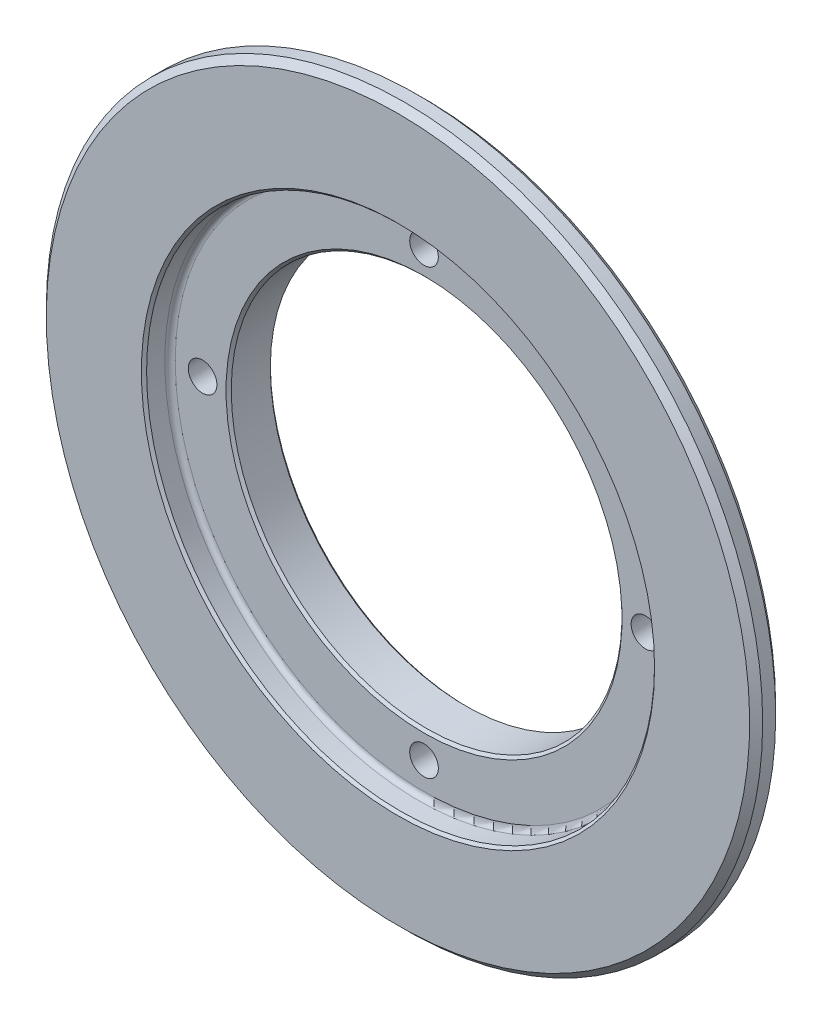
ISO-10303-21;
HEADER;
FILE_DESCRIPTION(('STEP AP214'),'2;1');
FILE_NAME('part.step','',(''),(''),'','','');
FILE_SCHEMA(('AUTOMOTIVE_DESIGN { 1 0 10303 214 1 1 1 1 }'));
ENDSEC;
DATA;
#1=APPLICATION_CONTEXT('core data for automotive mechanical design processes');
#2=APPLICATION_PROTOCOL_DEFINITION('international standard','automotive_design',2000,#1);
#3=PRODUCT_CONTEXT('',#1,'mechanical');
#4=PRODUCT('Part','Part','',(#3));
#5=PRODUCT_RELATED_PRODUCT_CATEGORY('part','',(#4));
#6=PRODUCT_DEFINITION_FORMATION('','',#4);
#7=PRODUCT_DEFINITION_CONTEXT('part definition',#1,'design');
#8=PRODUCT_DEFINITION('design','',#6,#7);
#9=PRODUCT_DEFINITION_SHAPE('','',#8);
#10=(LENGTH_UNIT() NAMED_UNIT(*) SI_UNIT(.MILLI.,.METRE.));
#11=(NAMED_UNIT(*) PLANE_ANGLE_UNIT() SI_UNIT($,.RADIAN.));
#12=(NAMED_UNIT(*) SI_UNIT($,.STERADIAN.) SOLID_ANGLE_UNIT());
#13=UNCERTAINTY_MEASURE_WITH_UNIT(LENGTH_MEASURE(1.E-05),#10,'distance_accuracy_value','');
#14=(GEOMETRIC_REPRESENTATION_CONTEXT(3) GLOBAL_UNCERTAINTY_ASSIGNED_CONTEXT((#13)) GLOBAL_UNIT_ASSIGNED_CONTEXT((#10,
#11,#12)) REPRESENTATION_CONTEXT('',''));
#15=CARTESIAN_POINT('',(0.,0.,0.));
#16=DIRECTION('',(0.,0.,1.));
#17=DIRECTION('',(1.,0.,0.));
#18=AXIS2_PLACEMENT_3D('',#15,#16,#17);
#19=CARTESIAN_POINT('',(0.,0.,0.500000000000043));
#20=DIRECTION('',(0.,0.,1.));
#21=DIRECTION('',(1.,0.,0.));
#22=AXIS2_PLACEMENT_3D('',#19,#20,#21);
#23=CONICAL_SURFACE('',#22,21.,0.7853981633973);
#24=CARTESIAN_POINT('',(0.,0.,0.5));
#25=DIRECTION('',(0.,0.,1.));
#26=DIRECTION('',(1.,0.,0.));
#27=AXIS2_PLACEMENT_3D('',#24,#25,#26);
#28=CIRCLE('',#27,21.);
#29=CARTESIAN_POINT('',(21.,0.,0.5));
#30=VERTEX_POINT('',#29);
#31=EDGE_CURVE('E123',#30,#30,#28,.T.);
#32=ORIENTED_EDGE('',*,*,#31,.F.);
#33=EDGE_LOOP('',(#32));
#34=FACE_BOUND('',#33,.T.);
#35=CARTESIAN_POINT('',(0.,0.,0.));
#36=DIRECTION('',(0.,0.,1.));
#37=DIRECTION('',(1.,0.,0.));
#38=AXIS2_PLACEMENT_3D('',#35,#36,#37);
#39=CIRCLE('',#38,20.5);
#40=CARTESIAN_POINT('',(20.5,0.,0.));
#41=VERTEX_POINT('',#40);
#42=EDGE_CURVE('E122',#41,#41,#39,.T.);
#43=ORIENTED_EDGE('',*,*,#42,.T.);
#44=EDGE_LOOP('',(#43));
#45=FACE_BOUND('',#44,.T.);
#46=ADVANCED_FACE('F17',(#34,#45),#23,.T.);
#47=CARTESIAN_POINT('',(0.,0.,0.));
#48=DIRECTION('',(0.,0.,-1.));
#49=DIRECTION('',(-1.,0.,0.));
#50=AXIS2_PLACEMENT_3D('',#47,#48,#49);
#51=CONICAL_SURFACE('',#50,15.2,0.785398163397301);
#52=CARTESIAN_POINT('',(0.,0.,0.2));
#53=DIRECTION('',(0.,0.,1.));
#54=DIRECTION('',(1.,0.,0.));
#55=AXIS2_PLACEMENT_3D('',#52,#53,#54);
#56=CIRCLE('',#55,15.);
#57=CARTESIAN_POINT('',(15.,0.,0.2));
#58=VERTEX_POINT('',#57);
#59=EDGE_CURVE('E119',#58,#58,#56,.T.);
#60=ORIENTED_EDGE('',*,*,#59,.T.);
#61=EDGE_LOOP('',(#60));
#62=FACE_BOUND('',#61,.T.);
#63=CARTESIAN_POINT('',(0.,0.,0.));
#64=DIRECTION('',(0.,0.,-1.));
#65=DIRECTION('',(-1.,0.,0.));
#66=AXIS2_PLACEMENT_3D('',#63,#64,#65);
#67=CIRCLE('',#66,15.2);
#68=CARTESIAN_POINT('',(-15.2,0.,0.));
#69=VERTEX_POINT('',#68);
#70=EDGE_CURVE('E118',#69,#69,#67,.T.);
#71=ORIENTED_EDGE('',*,*,#70,.T.);
#72=EDGE_LOOP('',(#71));
#73=FACE_BOUND('',#72,.T.);
#74=ADVANCED_FACE('F275',(#62,#73),#51,.F.);
#75=CARTESIAN_POINT('',(0.,0.,-0.17));
#76=DIRECTION('',(0.,0.,1.));
#77=DIRECTION('',(1.,0.,0.));
#78=AXIS2_PLACEMENT_3D('',#75,#76,#77);
#79=CYLINDRICAL_SURFACE('',#78,21.);
#80=ORIENTED_EDGE('',*,*,#31,.T.);
#81=EDGE_LOOP('',(#80));
#82=FACE_BOUND('',#81,.T.);
#83=CARTESIAN_POINT('',(0.,0.,3.));
#84=DIRECTION('',(0.,0.,1.));
#85=DIRECTION('',(0.00767535320891425,0.999970544042732,0.));
#86=AXIS2_PLACEMENT_3D('',#83,#84,#85);
#87=CIRCLE('',#86,21.);
#88=CARTESIAN_POINT('',(0.161182417387199,20.9993814248974,3.));
#89=VERTEX_POINT('',#88);
#90=EDGE_CURVE('E114',#89,#89,#87,.F.);
#91=ORIENTED_EDGE('',*,*,#90,.T.);
#92=EDGE_LOOP('',(#91));
#93=FACE_BOUND('',#92,.T.);
#94=ADVANCED_FACE('F280',(#82,#93),#79,.T.);
#95=CARTESIAN_POINT('',(0.,0.,-0.837));
#96=DIRECTION('',(0.,0.,1.));
#97=DIRECTION('',(1.,0.,0.));
#98=AXIS2_PLACEMENT_3D('',#95,#96,#97);
#99=CYLINDRICAL_SURFACE('',#98,15.);
#100=CARTESIAN_POINT('',(0.,0.,3.19999999999998));
#101=DIRECTION('',(0.,0.,1.));
#102=DIRECTION('',(-1.,0.,0.));
#103=AXIS2_PLACEMENT_3D('',#100,#101,#102);
#104=CIRCLE('',#103,15.);
#105=CARTESIAN_POINT('',(-15.,0.,3.19999999999998));
#106=VERTEX_POINT('',#105);
#107=EDGE_CURVE('E105',#106,#106,#104,.T.);
#108=ORIENTED_EDGE('',*,*,#107,.T.);
#109=EDGE_LOOP('',(#108));
#110=FACE_BOUND('',#109,.T.);
#111=ORIENTED_EDGE('',*,*,#59,.F.);
#112=EDGE_LOOP('',(#111));
#113=FACE_BOUND('',#112,.T.);
#114=ADVANCED_FACE('F270',(#110,#113),#99,.F.);
#115=CARTESIAN_POINT('',(0.,0.,0.));
#116=DIRECTION('',(0.,0.,1.));
#117=DIRECTION('',(1.,0.,0.));
#118=AXIS2_PLACEMENT_3D('',#115,#116,#117);
#119=PLANE('',#118);
#120=CARTESIAN_POINT('',(0.,17.,0.));
#121=DIRECTION('',(0.,0.,-1.));
#122=DIRECTION('',(-1.,0.,0.));
#123=AXIS2_PLACEMENT_3D('',#120,#121,#122);
#124=CIRCLE('',#123,1.1);
#125=CARTESIAN_POINT('',(-1.1,17.,0.));
#126=VERTEX_POINT('',#125);
#127=EDGE_CURVE('E59',#126,#126,#124,.F.);
#128=ORIENTED_EDGE('',*,*,#127,.T.);
#129=EDGE_LOOP('',(#128));
#130=FACE_BOUND('',#129,.T.);
#131=ORIENTED_EDGE('',*,*,#70,.F.);
#132=EDGE_LOOP('',(#131));
#133=FACE_BOUND('',#132,.T.);
#134=CARTESIAN_POINT('',(17.,0.,0.));
#135=DIRECTION('',(0.,0.,-1.));
#136=DIRECTION('',(-1.,0.,0.));
#137=AXIS2_PLACEMENT_3D('',#134,#135,#136);
#138=CIRCLE('',#137,1.1);
#139=CARTESIAN_POINT('',(15.9,0.,0.));
#140=VERTEX_POINT('',#139);
#141=EDGE_CURVE('E113',#140,#140,#138,.F.);
#142=ORIENTED_EDGE('',*,*,#141,.T.);
#143=EDGE_LOOP('',(#142));
#144=FACE_BOUND('',#143,.T.);
#145=CARTESIAN_POINT('',(0.,-17.,0.));
#146=DIRECTION('',(0.,0.,-1.));
#147=DIRECTION('',(-1.,0.,0.));
#148=AXIS2_PLACEMENT_3D('',#145,#146,#147);
#149=CIRCLE('',#148,1.1);
#150=CARTESIAN_POINT('',(-1.1,-17.,0.));
#151=VERTEX_POINT('',#150);
#152=EDGE_CURVE('E151',#151,#151,#149,.F.);
#153=ORIENTED_EDGE('',*,*,#152,.T.);
#154=EDGE_LOOP('',(#153));
#155=FACE_BOUND('',#154,.T.);
#156=CARTESIAN_POINT('',(-17.,0.,0.));
#157=DIRECTION('',(0.,0.,-1.));
#158=DIRECTION('',(-1.,0.,0.));
#159=AXIS2_PLACEMENT_3D('',#156,#157,#158);
#160=CIRCLE('',#159,1.1);
#161=CARTESIAN_POINT('',(-18.1,0.,0.));
#162=VERTEX_POINT('',#161);
#163=EDGE_CURVE('E117',#162,#162,#160,.F.);
#164=ORIENTED_EDGE('',*,*,#163,.T.);
#165=EDGE_LOOP('',(#164));
#166=FACE_BOUND('',#165,.T.);
#167=ORIENTED_EDGE('',*,*,#42,.F.);
#168=EDGE_LOOP('',(#167));
#169=FACE_BOUND('',#168,.T.);
#170=ADVANCED_FACE('F98',(#130,#133,#144,#155,#166,#169),#119,.F.);
#171=CARTESIAN_POINT('',(0.,0.,3.));
#172=DIRECTION('',(0.,0.,1.));
#173=DIRECTION('',(0.00767535320891425,0.999970544042732,0.));
#174=AXIS2_PLACEMENT_3D('',#171,#172,#173);
#175=TOROIDAL_SURFACE('',#174,21.4,0.4);
#176=CARTESIAN_POINT('',(0.,0.,3.4));
#177=DIRECTION('',(0.,0.,-1.));
#178=DIRECTION('',(0.,-1.,0.));
#179=AXIS2_PLACEMENT_3D('',#176,#177,#178);
#180=CIRCLE('',#179,21.400000027635);
#181=CARTESIAN_POINT('',(0.,-21.400000038689,3.4));
#182=VERTEX_POINT('',#181);
#183=CARTESIAN_POINT('',(0.,21.400000038689,3.4));
#184=VERTEX_POINT('',#183);
#185=EDGE_CURVE('E47',#182,#184,#180,.T.);
#186=ORIENTED_EDGE('',*,*,#185,.T.);
#187=CARTESIAN_POINT('',(0.,0.,3.4));
#188=DIRECTION('',(0.,0.,-1.));
#189=DIRECTION('',(0.,1.,0.));
#190=AXIS2_PLACEMENT_3D('',#187,#188,#189);
#191=CIRCLE('',#190,21.40000005527);
#192=EDGE_CURVE('E45',#184,#182,#191,.T.);
#193=ORIENTED_EDGE('',*,*,#192,.T.);
#194=EDGE_LOOP('',(#186,#193));
#195=FACE_BOUND('',#194,.T.);
#196=ORIENTED_EDGE('',*,*,#90,.F.);
#197=EDGE_LOOP('',(#196));
#198=FACE_BOUND('',#197,.T.);
#199=ADVANCED_FACE('F49',(#195,#198),#175,.F.);
#200=CARTESIAN_POINT('',(-17.,0.,3.4));
#201=DIRECTION('',(0.,0.,-1.));
#202=DIRECTION('',(-1.,0.,0.));
#203=AXIS2_PLACEMENT_3D('',#200,#201,#202);
#204=CYLINDRICAL_SURFACE('',#203,1.1);
#205=CARTESIAN_POINT('',(-17.,0.,3.4));
#206=DIRECTION('',(0.,0.,-1.));
#207=DIRECTION('',(-1.,0.,0.));
#208=AXIS2_PLACEMENT_3D('',#205,#206,#207);
#209=CIRCLE('',#208,1.1);
#210=CARTESIAN_POINT('',(-18.1,0.,3.4));
#211=VERTEX_POINT('',#210);
#212=EDGE_CURVE('E53',#211,#211,#209,.T.);
#213=ORIENTED_EDGE('',*,*,#212,.F.);
#214=EDGE_LOOP('',(#213));
#215=FACE_BOUND('',#214,.T.);
#216=ORIENTED_EDGE('',*,*,#163,.F.);
#217=EDGE_LOOP('',(#216));
#218=FACE_BOUND('',#217,.T.);
#219=ADVANCED_FACE('F97',(#215,#218),#204,.F.);
#220=CARTESIAN_POINT('',(0.,-17.,3.4));
#221=DIRECTION('',(0.,0.,-1.));
#222=DIRECTION('',(-1.,0.,0.));
#223=AXIS2_PLACEMENT_3D('',#220,#221,#222);
#224=CYLINDRICAL_SURFACE('',#223,1.1);
#225=CARTESIAN_POINT('',(0.,-17.,3.4));
#226=DIRECTION('',(0.,0.,-1.));
#227=DIRECTION('',(-1.,0.,0.));
#228=AXIS2_PLACEMENT_3D('',#225,#226,#227);
#229=CIRCLE('',#228,1.1);
#230=CARTESIAN_POINT('',(-1.1,-17.,3.4));
#231=VERTEX_POINT('',#230);
#232=EDGE_CURVE('E142',#231,#231,#229,.T.);
#233=ORIENTED_EDGE('',*,*,#232,.F.);
#234=EDGE_LOOP('',(#233));
#235=FACE_BOUND('',#234,.T.);
#236=ORIENTED_EDGE('',*,*,#152,.F.);
#237=EDGE_LOOP('',(#236));
#238=FACE_BOUND('',#237,.T.);
#239=ADVANCED_FACE('F265',(#235,#238),#224,.F.);
#240=CARTESIAN_POINT('',(17.,0.,3.4));
#241=DIRECTION('',(0.,0.,-1.));
#242=DIRECTION('',(-1.,0.,0.));
#243=AXIS2_PLACEMENT_3D('',#240,#241,#242);
#244=CYLINDRICAL_SURFACE('',#243,1.1);
#245=CARTESIAN_POINT('',(17.,0.,3.4));
#246=DIRECTION('',(0.,0.,-1.));
#247=DIRECTION('',(-1.,0.,0.));
#248=AXIS2_PLACEMENT_3D('',#245,#246,#247);
#249=CIRCLE('',#248,1.1);
#250=CARTESIAN_POINT('',(15.9,0.,3.4));
#251=VERTEX_POINT('',#250);
#252=EDGE_CURVE('E139',#251,#251,#249,.T.);
#253=ORIENTED_EDGE('',*,*,#252,.F.);
#254=EDGE_LOOP('',(#253));
#255=FACE_BOUND('',#254,.T.);
#256=ORIENTED_EDGE('',*,*,#141,.F.);
#257=EDGE_LOOP('',(#256));
#258=FACE_BOUND('',#257,.T.);
#259=ADVANCED_FACE('F306',(#255,#258),#244,.F.);
#260=CARTESIAN_POINT('',(0.,0.,3.40000000000002));
#261=DIRECTION('',(0.,0.,1.));
#262=DIRECTION('',(0.,-1.,0.));
#263=AXIS2_PLACEMENT_3D('',#260,#261,#262);
#264=CONICAL_SURFACE('',#263,15.2,0.785398163397299);
#265=ORIENTED_EDGE('',*,*,#107,.F.);
#266=EDGE_LOOP('',(#265));
#267=FACE_BOUND('',#266,.T.);
#268=CARTESIAN_POINT('',(0.,0.,3.40000000000002));
#269=DIRECTION('',(0.,0.,1.));
#270=DIRECTION('',(0.,-1.,0.));
#271=AXIS2_PLACEMENT_3D('',#268,#269,#270);
#272=CIRCLE('',#271,15.2);
#273=CARTESIAN_POINT('',(0.,-15.2,3.40000000000002));
#274=VERTEX_POINT('',#273);
#275=EDGE_CURVE('E136',#274,#274,#272,.F.);
#276=ORIENTED_EDGE('',*,*,#275,.F.);
#277=EDGE_LOOP('',(#276));
#278=FACE_BOUND('',#277,.T.);
#279=ADVANCED_FACE('F311',(#267,#278),#264,.F.);
#280=CARTESIAN_POINT('',(0.,17.,3.4));
#281=DIRECTION('',(0.,0.,-1.));
#282=DIRECTION('',(-1.,0.,0.));
#283=AXIS2_PLACEMENT_3D('',#280,#281,#282);
#284=CYLINDRICAL_SURFACE('',#283,1.1);
#285=CARTESIAN_POINT('',(0.,17.,3.4));
#286=DIRECTION('',(0.,0.,-1.));
#287=DIRECTION('',(-1.,0.,0.));
#288=AXIS2_PLACEMENT_3D('',#285,#286,#287);
#289=CIRCLE('',#288,1.1);
#290=CARTESIAN_POINT('',(-1.1,17.,3.4));
#291=VERTEX_POINT('',#290);
#292=EDGE_CURVE('E133',#291,#291,#289,.T.);
#293=ORIENTED_EDGE('',*,*,#292,.F.);
#294=EDGE_LOOP('',(#293));
#295=FACE_BOUND('',#294,.T.);
#296=ORIENTED_EDGE('',*,*,#127,.F.);
#297=EDGE_LOOP('',(#296));
#298=FACE_BOUND('',#297,.T.);
#299=ADVANCED_FACE('F80',(#295,#298),#284,.F.);
#300=CARTESIAN_POINT('',(0.,0.,3.4));
#301=DIRECTION('',(0.,0.,1.));
#302=DIRECTION('',(1.,0.,0.));
#303=AXIS2_PLACEMENT_3D('',#300,#301,#302);
#304=PLANE('',#303);
#305=ORIENTED_EDGE('',*,*,#192,.F.);
#306=ORIENTED_EDGE('',*,*,#185,.F.);
#307=EDGE_LOOP('',(#305,#306));
#308=FACE_BOUND('',#307,.T.);
#309=CARTESIAN_POINT('',(0.,0.,3.39999999999996));
#310=DIRECTION('',(0.,0.,1.));
#311=DIRECTION('',(1.,0.,0.));
#312=AXIS2_PLACEMENT_3D('',#309,#310,#311);
#313=CIRCLE('',#312,27.);
#314=CARTESIAN_POINT('',(27.,0.,3.39999999999996));
#315=VERTEX_POINT('',#314);
#316=EDGE_CURVE('E129',#315,#315,#313,.T.);
#317=ORIENTED_EDGE('',*,*,#316,.F.);
#318=EDGE_LOOP('',(#317));
#319=FACE_BOUND('',#318,.T.);
#320=ADVANCED_FACE('F57',(#308,#319),#304,.F.);
#321=CARTESIAN_POINT('',(0.,0.,3.4));
#322=DIRECTION('',(0.,0.,1.));
#323=DIRECTION('',(1.,0.,0.));
#324=AXIS2_PLACEMENT_3D('',#321,#322,#323);
#325=PLANE('',#324);
#326=ORIENTED_EDGE('',*,*,#292,.T.);
#327=EDGE_LOOP('',(#326));
#328=FACE_BOUND('',#327,.T.);
#329=ORIENTED_EDGE('',*,*,#275,.T.);
#330=EDGE_LOOP('',(#329));
#331=FACE_BOUND('',#330,.T.);
#332=ORIENTED_EDGE('',*,*,#252,.T.);
#333=EDGE_LOOP('',(#332));
#334=FACE_BOUND('',#333,.T.);
#335=ORIENTED_EDGE('',*,*,#232,.T.);
#336=EDGE_LOOP('',(#335));
#337=FACE_BOUND('',#336,.T.);
#338=ORIENTED_EDGE('',*,*,#212,.T.);
#339=EDGE_LOOP('',(#338));
#340=FACE_BOUND('',#339,.T.);
#341=CARTESIAN_POINT('',(0.,0.,3.40000000000001));
#342=DIRECTION('',(0.,0.,-1.));
#343=DIRECTION('',(1.,0.,0.));
#344=AXIS2_PLACEMENT_3D('',#341,#342,#343);
#345=CIRCLE('',#344,19.10000006849);
#346=CARTESIAN_POINT('',(-19.100000061641,0.,3.4));
#347=VERTEX_POINT('',#346);
#348=CARTESIAN_POINT('',(19.100000061641,0.,3.4));
#349=VERTEX_POINT('',#348);
#350=EDGE_CURVE('E36',#347,#349,#345,.F.);
#351=ORIENTED_EDGE('',*,*,#350,.T.);
#352=CARTESIAN_POINT('',(0.,0.,3.40000000000001));
#353=DIRECTION('',(0.,0.,-1.));
#354=DIRECTION('',(-1.,0.,0.));
#355=AXIS2_PLACEMENT_3D('',#352,#353,#354);
#356=CIRCLE('',#355,19.10000006849);
#357=EDGE_CURVE('E132',#349,#347,#356,.F.);
#358=ORIENTED_EDGE('',*,*,#357,.T.);
#359=EDGE_LOOP('',(#351,#358));
#360=FACE_BOUND('',#359,.T.);
#361=ADVANCED_FACE('F79',(#328,#331,#334,#337,#340,#360),#325,.T.);
#362=CARTESIAN_POINT('',(0.,0.,3.90000000000004));
#363=DIRECTION('',(0.,0.,1.));
#364=DIRECTION('',(1.,0.,0.));
#365=AXIS2_PLACEMENT_3D('',#362,#363,#364);
#366=CONICAL_SURFACE('',#365,27.5,0.785398163397299);
#367=ORIENTED_EDGE('',*,*,#316,.T.);
#368=EDGE_LOOP('',(#367));
#369=FACE_BOUND('',#368,.T.);
#370=CARTESIAN_POINT('',(0.,0.,3.9));
#371=DIRECTION('',(0.,0.,1.));
#372=DIRECTION('',(1.,0.,0.));
#373=AXIS2_PLACEMENT_3D('',#370,#371,#372);
#374=CIRCLE('',#373,27.5);
#375=CARTESIAN_POINT('',(27.5,0.,3.9));
#376=VERTEX_POINT('',#375);
#377=EDGE_CURVE('E183',#376,#376,#374,.T.);
#378=ORIENTED_EDGE('',*,*,#377,.F.);
#379=EDGE_LOOP('',(#378));
#380=FACE_BOUND('',#379,.T.);
#381=ADVANCED_FACE('F175',(#369,#380),#366,.T.);
#382=CARTESIAN_POINT('',(0.,0.,3.8));
#383=DIRECTION('',(0.,0.,1.));
#384=DIRECTION('',(-0.999965838088188,0.0082657520279289,0.));
#385=AXIS2_PLACEMENT_3D('',#382,#383,#384);
#386=TOROIDAL_SURFACE('',#385,19.1,0.4);
#387=ORIENTED_EDGE('',*,*,#350,.F.);
#388=ORIENTED_EDGE('',*,*,#357,.F.);
#389=EDGE_LOOP('',(#387,#388));
#390=FACE_BOUND('',#389,.T.);
#391=CARTESIAN_POINT('',(0.,0.,3.8));
#392=DIRECTION('',(0.,0.,1.));
#393=DIRECTION('',(1.,0.,0.));
#394=AXIS2_PLACEMENT_3D('',#391,#392,#393);
#395=CIRCLE('',#394,19.5);
#396=CARTESIAN_POINT('',(19.5,0.,3.8));
#397=VERTEX_POINT('',#396);
#398=EDGE_CURVE('E181',#397,#397,#395,.T.);
#399=ORIENTED_EDGE('',*,*,#398,.T.);
#400=EDGE_LOOP('',(#399));
#401=FACE_BOUND('',#400,.T.);
#402=ADVANCED_FACE('F164',(#390,#401),#386,.F.);
#403=CARTESIAN_POINT('',(0.,0.,0.));
#404=DIRECTION('',(0.,0.,1.));
#405=DIRECTION('',(1.,0.,0.));
#406=AXIS2_PLACEMENT_3D('',#403,#404,#405);
#407=CYLINDRICAL_SURFACE('',#406,27.5);
#408=CARTESIAN_POINT('',(0.,0.,4.89999999999996));
#409=DIRECTION('',(0.,0.,-1.));
#410=DIRECTION('',(-1.,0.,0.));
#411=AXIS2_PLACEMENT_3D('',#408,#409,#410);
#412=CIRCLE('',#411,27.5);
#413=CARTESIAN_POINT('',(-27.5,0.,4.89999999999996));
#414=VERTEX_POINT('',#413);
#415=EDGE_CURVE('E206',#414,#414,#412,.F.);
#416=ORIENTED_EDGE('',*,*,#415,.F.);
#417=EDGE_LOOP('',(#416));
#418=FACE_BOUND('',#417,.T.);
#419=ORIENTED_EDGE('',*,*,#377,.T.);
#420=EDGE_LOOP('',(#419));
#421=FACE_BOUND('',#420,.T.);
#422=ADVANCED_FACE('F174',(#418,#421),#407,.T.);
#423=CARTESIAN_POINT('',(0.,0.,-0.837));
#424=DIRECTION('',(0.,0.,1.));
#425=DIRECTION('',(1.,0.,0.));
#426=AXIS2_PLACEMENT_3D('',#423,#424,#425);
#427=CYLINDRICAL_SURFACE('',#426,19.5);
#428=CARTESIAN_POINT('',(0.,0.,5.19999999999998));
#429=DIRECTION('',(0.,0.,1.));
#430=DIRECTION('',(-1.,0.,0.));
#431=AXIS2_PLACEMENT_3D('',#428,#429,#430);
#432=CIRCLE('',#431,19.5);
#433=CARTESIAN_POINT('',(-19.5,0.,5.19999999999998));
#434=VERTEX_POINT('',#433);
#435=EDGE_CURVE('E128',#434,#434,#432,.T.);
#436=ORIENTED_EDGE('',*,*,#435,.T.);
#437=EDGE_LOOP('',(#436));
#438=FACE_BOUND('',#437,.T.);
#439=ORIENTED_EDGE('',*,*,#398,.F.);
#440=EDGE_LOOP('',(#439));
#441=FACE_BOUND('',#440,.T.);
#442=ADVANCED_FACE('F214',(#438,#441),#427,.F.);
#443=CARTESIAN_POINT('',(0.,0.,4.89999999999996));
#444=DIRECTION('',(0.,0.,-1.));
#445=DIRECTION('',(0.,1.,0.));
#446=AXIS2_PLACEMENT_3D('',#443,#444,#445);
#447=CONICAL_SURFACE('',#446,27.5,0.7853981633973);
#448=ORIENTED_EDGE('',*,*,#415,.T.);
#449=EDGE_LOOP('',(#448));
#450=FACE_BOUND('',#449,.T.);
#451=CARTESIAN_POINT('',(0.,0.,5.40000000000004));
#452=DIRECTION('',(0.,0.,-1.));
#453=DIRECTION('',(0.,1.,0.));
#454=AXIS2_PLACEMENT_3D('',#451,#452,#453);
#455=CIRCLE('',#454,27.);
#456=CARTESIAN_POINT('',(0.,27.,5.40000000000004));
#457=VERTEX_POINT('',#456);
#458=EDGE_CURVE('E28',#457,#457,#455,.F.);
#459=ORIENTED_EDGE('',*,*,#458,.F.);
#460=EDGE_LOOP('',(#459));
#461=FACE_BOUND('',#460,.T.);
#462=ADVANCED_FACE('F220',(#450,#461),#447,.T.);
#463=CARTESIAN_POINT('',(0.,0.,5.40000000000001));
#464=DIRECTION('',(0.,0.,1.));
#465=DIRECTION('',(1.,0.,0.));
#466=AXIS2_PLACEMENT_3D('',#463,#464,#465);
#467=CONICAL_SURFACE('',#466,19.7,0.785398163397299);
#468=ORIENTED_EDGE('',*,*,#435,.F.);
#469=EDGE_LOOP('',(#468));
#470=FACE_BOUND('',#469,.T.);
#471=CARTESIAN_POINT('',(0.,0.,5.40000000000001));
#472=DIRECTION('',(0.,0.,1.));
#473=DIRECTION('',(1.,0.,0.));
#474=AXIS2_PLACEMENT_3D('',#471,#472,#473);
#475=CIRCLE('',#474,19.7);
#476=CARTESIAN_POINT('',(19.7,0.,5.40000000000001));
#477=VERTEX_POINT('',#476);
#478=EDGE_CURVE('E11',#477,#477,#475,.F.);
#479=ORIENTED_EDGE('',*,*,#478,.F.);
#480=EDGE_LOOP('',(#479));
#481=FACE_BOUND('',#480,.T.);
#482=ADVANCED_FACE('F216',(#470,#481),#467,.F.);
#483=CARTESIAN_POINT('',(0.,0.,5.4));
#484=DIRECTION('',(0.,0.,1.));
#485=DIRECTION('',(1.,0.,0.));
#486=AXIS2_PLACEMENT_3D('',#483,#484,#485);
#487=PLANE('',#486);
#488=ORIENTED_EDGE('',*,*,#478,.T.);
#489=EDGE_LOOP('',(#488));
#490=FACE_BOUND('',#489,.T.);
#491=ORIENTED_EDGE('',*,*,#458,.T.);
#492=EDGE_LOOP('',(#491));
#493=FACE_BOUND('',#492,.T.);
#494=ADVANCED_FACE('F219',(#490,#493),#487,.T.);
#495=CLOSED_SHELL('',(#46,#74,#94,#114,#170,#199,#219,#239,#259,#279,#299,#320,#361,#381,#402,
#422,#442,#462,#482,#494));
#496=MANIFOLD_SOLID_BREP('B1',#495);
#497=ADVANCED_BREP_SHAPE_REPRESENTATION('',(#18,#496),#14);
#498=SHAPE_DEFINITION_REPRESENTATION(#9,#497);
ENDSEC;
END-ISO-10303-21;
